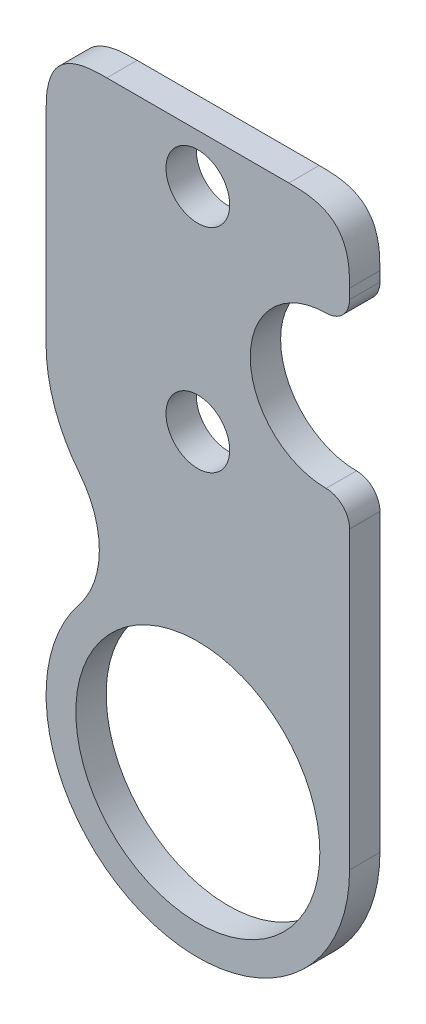
ISO-10303-21;
HEADER;
FILE_DESCRIPTION(('STEP AP214'),'2;1');
FILE_NAME('part.step','',(''),(''),'','','');
FILE_SCHEMA(('AUTOMOTIVE_DESIGN { 1 0 10303 214 1 1 1 1 }'));
ENDSEC;
DATA;
#1=APPLICATION_CONTEXT('core data for automotive mechanical design processes');
#2=APPLICATION_PROTOCOL_DEFINITION('international standard','automotive_design',2000,#1);
#3=PRODUCT_CONTEXT('',#1,'mechanical');
#4=PRODUCT('Part','Part','',(#3));
#5=PRODUCT_RELATED_PRODUCT_CATEGORY('part','',(#4));
#6=PRODUCT_DEFINITION_FORMATION('','',#4);
#7=PRODUCT_DEFINITION_CONTEXT('part definition',#1,'design');
#8=PRODUCT_DEFINITION('design','',#6,#7);
#9=PRODUCT_DEFINITION_SHAPE('','',#8);
#10=(LENGTH_UNIT() NAMED_UNIT(*) SI_UNIT(.MILLI.,.METRE.));
#11=(NAMED_UNIT(*) PLANE_ANGLE_UNIT() SI_UNIT($,.RADIAN.));
#12=(NAMED_UNIT(*) SI_UNIT($,.STERADIAN.) SOLID_ANGLE_UNIT());
#13=UNCERTAINTY_MEASURE_WITH_UNIT(LENGTH_MEASURE(1.E-05),#10,'distance_accuracy_value','');
#14=(GEOMETRIC_REPRESENTATION_CONTEXT(3) GLOBAL_UNCERTAINTY_ASSIGNED_CONTEXT((#13)) GLOBAL_UNIT_ASSIGNED_CONTEXT((#10,
#11,#12)) REPRESENTATION_CONTEXT('',''));
#15=CARTESIAN_POINT('',(0.,0.,0.));
#16=DIRECTION('',(0.,0.,1.));
#17=DIRECTION('',(1.,0.,0.));
#18=AXIS2_PLACEMENT_3D('',#15,#16,#17);
#19=CARTESIAN_POINT('',(25.,59.,-5.));
#20=DIRECTION('',(1.,0.,0.));
#21=DIRECTION('',(0.,0.,-1.));
#22=AXIS2_PLACEMENT_3D('',#19,#20,#21);
#23=PLANE('',#22);
#24=DIRECTION('',(0.,1.,0.));
#25=VECTOR('',#24,1.);
#26=CARTESIAN_POINT('',(25.,59.,-5.));
#27=LINE('',#26,#25);
#28=CARTESIAN_POINT('',(25.,47.36,-5.));
#29=VERTEX_POINT('',#28);
#30=CARTESIAN_POINT('',(25.,49.,-5.));
#31=VERTEX_POINT('',#30);
#32=EDGE_CURVE('E209',#29,#31,#27,.T.);
#33=ORIENTED_EDGE('',*,*,#32,.T.);
#34=CARTESIAN_POINT('',(25.,49.,0.250000000000083));
#35=CARTESIAN_POINT('',(25.,49.,-1.58333333333327));
#36=CARTESIAN_POINT('',(25.,49.,-3.4166666666664));
#37=CARTESIAN_POINT('',(25.,49.,-5.24999999999998));
#38=B_SPLINE_CURVE_WITH_KNOTS('',3,(#34,#35,#36,#37),.UNSPECIFIED.,.F.,.F.,(4,4),(-0.00025,
0.00525),.UNSPECIFIED.);
#39=CARTESIAN_POINT('',(25.,49.,0.));
#40=VERTEX_POINT('',#39);
#41=EDGE_CURVE('E223',#31,#40,#38,.F.);
#42=ORIENTED_EDGE('',*,*,#41,.T.);
#43=DIRECTION('',(0.,1.,0.));
#44=VECTOR('',#43,1.);
#45=CARTESIAN_POINT('',(25.,59.,0.));
#46=LINE('',#45,#44);
#47=CARTESIAN_POINT('',(25.,47.36,0.));
#48=VERTEX_POINT('',#47);
#49=EDGE_CURVE('E200',#48,#40,#46,.T.);
#50=ORIENTED_EDGE('',*,*,#49,.F.);
#51=DIRECTION('',(0.,0.,1.));
#52=VECTOR('',#51,1.);
#53=CARTESIAN_POINT('',(25.,47.36,-5.));
#54=LINE('',#53,#52);
#55=EDGE_CURVE('E402',#29,#48,#54,.T.);
#56=ORIENTED_EDGE('',*,*,#55,.F.);
#57=EDGE_LOOP('',(#33,#42,#50,#56));
#58=FACE_BOUND('',#57,.T.);
#59=ADVANCED_FACE('F44',(#58),#23,.T.);
#60=CARTESIAN_POINT('',(21.14,47.36,-5.));
#61=DIRECTION('',(0.,0.,1.));
#62=DIRECTION('',(1.,0.,0.));
#63=AXIS2_PLACEMENT_3D('',#60,#61,#62);
#64=CYLINDRICAL_SURFACE('',#63,3.86000000000001);
#65=CARTESIAN_POINT('',(21.14,47.36,0.));
#66=DIRECTION('',(0.,0.,1.));
#67=DIRECTION('',(1.,0.,0.));
#68=AXIS2_PLACEMENT_3D('',#65,#66,#67);
#69=CIRCLE('',#68,3.86000000000001);
#70=CARTESIAN_POINT('',(21.14,43.5,0.));
#71=VERTEX_POINT('',#70);
#72=EDGE_CURVE('E215',#71,#48,#69,.T.);
#73=ORIENTED_EDGE('',*,*,#72,.F.);
#74=DIRECTION('',(0.,0.,1.));
#75=VECTOR('',#74,1.);
#76=CARTESIAN_POINT('',(21.14,43.5,-5.));
#77=LINE('',#76,#75);
#78=CARTESIAN_POINT('',(21.14,43.5,-5.));
#79=VERTEX_POINT('',#78);
#80=EDGE_CURVE('E400',#79,#71,#77,.T.);
#81=ORIENTED_EDGE('',*,*,#80,.F.);
#82=CARTESIAN_POINT('',(21.14,47.36,-5.));
#83=DIRECTION('',(0.,0.,1.));
#84=DIRECTION('',(1.,0.,0.));
#85=AXIS2_PLACEMENT_3D('',#82,#83,#84);
#86=CIRCLE('',#85,3.86000000000001);
#87=EDGE_CURVE('E424',#79,#29,#86,.T.);
#88=ORIENTED_EDGE('',*,*,#87,.T.);
#89=ORIENTED_EDGE('',*,*,#55,.T.);
#90=EDGE_LOOP('',(#73,#81,#88,#89));
#91=FACE_BOUND('',#90,.T.);
#92=ADVANCED_FACE('F240',(#91),#64,.T.);
#93=CARTESIAN_POINT('',(21.14,31.,-5.));
#94=DIRECTION('',(0.,0.,1.));
#95=DIRECTION('',(1.,0.,0.));
#96=AXIS2_PLACEMENT_3D('',#93,#94,#95);
#97=CYLINDRICAL_SURFACE('',#96,12.5);
#98=CARTESIAN_POINT('',(21.14,31.,0.));
#99=DIRECTION('',(0.,0.,-1.));
#100=DIRECTION('',(1.,0.,0.));
#101=AXIS2_PLACEMENT_3D('',#98,#99,#100);
#102=CIRCLE('',#101,12.5);
#103=CARTESIAN_POINT('',(21.14,18.5,0.));
#104=VERTEX_POINT('',#103);
#105=EDGE_CURVE('E405',#104,#71,#102,.T.);
#106=ORIENTED_EDGE('',*,*,#105,.F.);
#107=DIRECTION('',(0.,0.,1.));
#108=VECTOR('',#107,1.);
#109=CARTESIAN_POINT('',(21.14,18.5,-5.));
#110=LINE('',#109,#108);
#111=CARTESIAN_POINT('',(21.14,18.5,-5.));
#112=VERTEX_POINT('',#111);
#113=EDGE_CURVE('E417',#112,#104,#110,.T.);
#114=ORIENTED_EDGE('',*,*,#113,.F.);
#115=CARTESIAN_POINT('',(21.14,31.,-5.));
#116=DIRECTION('',(0.,0.,-1.));
#117=DIRECTION('',(1.,0.,0.));
#118=AXIS2_PLACEMENT_3D('',#115,#116,#117);
#119=CIRCLE('',#118,12.5);
#120=EDGE_CURVE('E429',#112,#79,#119,.T.);
#121=ORIENTED_EDGE('',*,*,#120,.T.);
#122=ORIENTED_EDGE('',*,*,#80,.T.);
#123=EDGE_LOOP('',(#106,#114,#121,#122));
#124=FACE_BOUND('',#123,.T.);
#125=ADVANCED_FACE('F389',(#124),#97,.F.);
#126=CARTESIAN_POINT('',(21.14,14.64,-5.));
#127=DIRECTION('',(0.,0.,1.));
#128=DIRECTION('',(1.,0.,0.));
#129=AXIS2_PLACEMENT_3D('',#126,#127,#128);
#130=CYLINDRICAL_SURFACE('',#129,3.86);
#131=CARTESIAN_POINT('',(21.14,14.64,0.));
#132=DIRECTION('',(0.,0.,1.));
#133=DIRECTION('',(-1.,0.,0.));
#134=AXIS2_PLACEMENT_3D('',#131,#132,#133);
#135=CIRCLE('',#134,3.86);
#136=CARTESIAN_POINT('',(25.,14.64,0.));
#137=VERTEX_POINT('',#136);
#138=EDGE_CURVE('E409',#137,#104,#135,.T.);
#139=ORIENTED_EDGE('',*,*,#138,.F.);
#140=DIRECTION('',(0.,0.,1.));
#141=VECTOR('',#140,1.);
#142=CARTESIAN_POINT('',(25.,14.64,-5.));
#143=LINE('',#142,#141);
#144=CARTESIAN_POINT('',(25.,14.64,-5.));
#145=VERTEX_POINT('',#144);
#146=EDGE_CURVE('E420',#145,#137,#143,.T.);
#147=ORIENTED_EDGE('',*,*,#146,.F.);
#148=CARTESIAN_POINT('',(21.14,14.64,-5.));
#149=DIRECTION('',(0.,0.,1.));
#150=DIRECTION('',(-1.,0.,0.));
#151=AXIS2_PLACEMENT_3D('',#148,#149,#150);
#152=CIRCLE('',#151,3.86);
#153=EDGE_CURVE('E434',#145,#112,#152,.T.);
#154=ORIENTED_EDGE('',*,*,#153,.T.);
#155=ORIENTED_EDGE('',*,*,#113,.T.);
#156=EDGE_LOOP('',(#139,#147,#154,#155));
#157=FACE_BOUND('',#156,.T.);
#158=ADVANCED_FACE('F385',(#157),#130,.T.);
#159=CARTESIAN_POINT('',(25.,-34.,-5.));
#160=DIRECTION('',(1.,0.,0.));
#161=DIRECTION('',(0.,1.,0.));
#162=AXIS2_PLACEMENT_3D('',#159,#160,#161);
#163=PLANE('',#162);
#164=DIRECTION('',(0.,1.,0.));
#165=VECTOR('',#164,1.);
#166=CARTESIAN_POINT('',(25.,-34.,0.));
#167=LINE('',#166,#165);
#168=CARTESIAN_POINT('',(25.,-34.,0.));
#169=VERTEX_POINT('',#168);
#170=EDGE_CURVE('E510',#169,#137,#167,.T.);
#171=ORIENTED_EDGE('',*,*,#170,.F.);
#172=DIRECTION('',(0.,0.,1.));
#173=VECTOR('',#172,1.);
#174=CARTESIAN_POINT('',(25.,-34.,-5.));
#175=LINE('',#174,#173);
#176=CARTESIAN_POINT('',(25.,-34.,-5.));
#177=VERTEX_POINT('',#176);
#178=EDGE_CURVE('E422',#177,#169,#175,.T.);
#179=ORIENTED_EDGE('',*,*,#178,.F.);
#180=DIRECTION('',(0.,1.,0.));
#181=VECTOR('',#180,1.);
#182=CARTESIAN_POINT('',(25.,-34.,-5.));
#183=LINE('',#182,#181);
#184=EDGE_CURVE('E496',#177,#145,#183,.T.);
#185=ORIENTED_EDGE('',*,*,#184,.T.);
#186=ORIENTED_EDGE('',*,*,#146,.T.);
#187=EDGE_LOOP('',(#171,#179,#185,#186));
#188=FACE_BOUND('',#187,.T.);
#189=ADVANCED_FACE('F382',(#188),#163,.T.);
#190=CARTESIAN_POINT('',(0.,-34.,-5.));
#191=DIRECTION('',(0.,0.,1.));
#192=DIRECTION('',(1.,0.,0.));
#193=AXIS2_PLACEMENT_3D('',#190,#191,#192);
#194=CYLINDRICAL_SURFACE('',#193,25.);
#195=CARTESIAN_POINT('',(0.,-34.,0.));
#196=DIRECTION('',(0.,0.,1.));
#197=DIRECTION('',(1.,0.,0.));
#198=AXIS2_PLACEMENT_3D('',#195,#196,#197);
#199=CIRCLE('',#198,25.);
#200=CARTESIAN_POINT('',(-19.515618744995,-18.375,0.));
#201=VERTEX_POINT('',#200);
#202=EDGE_CURVE('E66',#201,#169,#199,.T.);
#203=ORIENTED_EDGE('',*,*,#202,.F.);
#204=DIRECTION('',(0.,0.,1.));
#205=VECTOR('',#204,1.);
#206=CARTESIAN_POINT('',(-19.515618744995,-18.375,-5.05));
#207=LINE('',#206,#205);
#208=CARTESIAN_POINT('',(-19.515618744995,-18.375,-5.));
#209=VERTEX_POINT('',#208);
#210=EDGE_CURVE('E154',#209,#201,#207,.T.);
#211=ORIENTED_EDGE('',*,*,#210,.F.);
#212=CARTESIAN_POINT('',(0.,-34.,-5.));
#213=DIRECTION('',(0.,0.,1.));
#214=DIRECTION('',(1.,0.,0.));
#215=AXIS2_PLACEMENT_3D('',#212,#213,#214);
#216=CIRCLE('',#215,25.);
#217=EDGE_CURVE('E491',#209,#177,#216,.T.);
#218=ORIENTED_EDGE('',*,*,#217,.T.);
#219=ORIENTED_EDGE('',*,*,#178,.T.);
#220=EDGE_LOOP('',(#203,#211,#218,#219));
#221=FACE_BOUND('',#220,.T.);
#222=ADVANCED_FACE('F379',(#221),#194,.T.);
#223=CARTESIAN_POINT('',(-25.,59.0000000000001,-5.));
#224=DIRECTION('',(-1.,0.,0.));
#225=DIRECTION('',(0.,-1.,0.));
#226=AXIS2_PLACEMENT_3D('',#223,#224,#225);
#227=PLANE('',#226);
#228=DIRECTION('',(0.,0.,1.));
#229=VECTOR('',#228,1.);
#230=CARTESIAN_POINT('',(-25.,16.0000000000001,-5.05));
#231=LINE('',#230,#229);
#232=CARTESIAN_POINT('',(-25.,16.0000000000001,-5.));
#233=VERTEX_POINT('',#232);
#234=CARTESIAN_POINT('',(-25.,16.0000000000001,0.));
#235=VERTEX_POINT('',#234);
#236=EDGE_CURVE('E153',#233,#235,#231,.T.);
#237=ORIENTED_EDGE('',*,*,#236,.T.);
#238=DIRECTION('',(0.,-1.,0.));
#239=VECTOR('',#238,1.);
#240=CARTESIAN_POINT('',(-25.,59.0000000000001,0.));
#241=LINE('',#240,#239);
#242=CARTESIAN_POINT('',(-25.,49.0000000000001,0.));
#243=VERTEX_POINT('',#242);
#244=EDGE_CURVE('E165',#243,#235,#241,.T.);
#245=ORIENTED_EDGE('',*,*,#244,.F.);
#246=CARTESIAN_POINT('',(-25.,49.0000000000001,-5.24999999999998));
#247=CARTESIAN_POINT('',(-25.,49.0000000000001,-3.4166666666664));
#248=CARTESIAN_POINT('',(-25.,49.0000000000001,-1.58333333333327));
#249=CARTESIAN_POINT('',(-25.,49.0000000000001,0.250000000000083));
#250=B_SPLINE_CURVE_WITH_KNOTS('',3,(#246,#247,#248,#249),.UNSPECIFIED.,.F.,.F.,(4,4),(-0.00025,
0.00525),.UNSPECIFIED.);
#251=CARTESIAN_POINT('',(-25.,49.0000000000001,-5.));
#252=VERTEX_POINT('',#251);
#253=EDGE_CURVE('E11',#243,#252,#250,.F.);
#254=ORIENTED_EDGE('',*,*,#253,.T.);
#255=DIRECTION('',(0.,-1.,0.));
#256=VECTOR('',#255,1.);
#257=CARTESIAN_POINT('',(-25.,59.0000000000001,-5.));
#258=LINE('',#257,#256);
#259=EDGE_CURVE('E469',#252,#233,#258,.T.);
#260=ORIENTED_EDGE('',*,*,#259,.T.);
#261=EDGE_LOOP('',(#237,#245,#254,#260));
#262=FACE_BOUND('',#261,.T.);
#263=ADVANCED_FACE('F370',(#262),#227,.T.);
#264=CARTESIAN_POINT('',(-25.,59.0000000000001,-5.));
#265=DIRECTION('',(0.,1.,0.));
#266=DIRECTION('',(-1.,0.,0.));
#267=AXIS2_PLACEMENT_3D('',#264,#265,#266);
#268=PLANE('',#267);
#269=DIRECTION('',(-1.,0.,0.));
#270=VECTOR('',#269,1.);
#271=CARTESIAN_POINT('',(-25.,59.0000000000001,0.));
#272=LINE('',#271,#270);
#273=CARTESIAN_POINT('',(15.,59.0000000000001,0.));
#274=VERTEX_POINT('',#273);
#275=CARTESIAN_POINT('',(-15.,59.0000000000002,0.));
#276=VERTEX_POINT('',#275);
#277=EDGE_CURVE('E229',#274,#276,#272,.T.);
#278=ORIENTED_EDGE('',*,*,#277,.F.);
#279=CARTESIAN_POINT('',(15.,59.0000000000001,-5.24999999999998));
#280=CARTESIAN_POINT('',(15.,59.0000000000001,-3.4166666666664));
#281=CARTESIAN_POINT('',(15.,59.0000000000001,-1.58333333333327));
#282=CARTESIAN_POINT('',(15.,59.0000000000001,0.250000000000083));
#283=B_SPLINE_CURVE_WITH_KNOTS('',3,(#279,#280,#281,#282),.UNSPECIFIED.,.F.,.F.,(4,4),(-0.00025,
0.00525),.UNSPECIFIED.);
#284=CARTESIAN_POINT('',(15.,59.0000000000001,-5.));
#285=VERTEX_POINT('',#284);
#286=EDGE_CURVE('E283',#274,#285,#283,.F.);
#287=ORIENTED_EDGE('',*,*,#286,.T.);
#288=DIRECTION('',(-1.,0.,0.));
#289=VECTOR('',#288,1.);
#290=CARTESIAN_POINT('',(-25.,59.0000000000001,-5.));
#291=LINE('',#290,#289);
#292=CARTESIAN_POINT('',(-15.,59.0000000000002,-5.));
#293=VERTEX_POINT('',#292);
#294=EDGE_CURVE('E214',#285,#293,#291,.T.);
#295=ORIENTED_EDGE('',*,*,#294,.T.);
#296=CARTESIAN_POINT('',(-15.,59.0000000000002,0.250000000000083));
#297=CARTESIAN_POINT('',(-15.,59.0000000000002,-1.58333333333327));
#298=CARTESIAN_POINT('',(-15.,59.0000000000002,-3.4166666666664));
#299=CARTESIAN_POINT('',(-15.,59.0000000000002,-5.24999999999998));
#300=B_SPLINE_CURVE_WITH_KNOTS('',3,(#296,#297,#298,#299),.UNSPECIFIED.,.F.,.F.,(4,4),(-0.00025,
0.00525),.UNSPECIFIED.);
#301=EDGE_CURVE('E307',#293,#276,#300,.F.);
#302=ORIENTED_EDGE('',*,*,#301,.T.);
#303=EDGE_LOOP('',(#278,#287,#295,#302));
#304=FACE_BOUND('',#303,.T.);
#305=ADVANCED_FACE('F241',(#304),#268,.T.);
#306=CARTESIAN_POINT('',(21.14,47.36,-5.));
#307=DIRECTION('',(0.,0.,1.));
#308=DIRECTION('',(1.,0.,0.));
#309=AXIS2_PLACEMENT_3D('',#306,#307,#308);
#310=PLANE('',#309);
#311=ORIENTED_EDGE('',*,*,#217,.F.);
#312=CARTESIAN_POINT('',(-31.224989991992,-9.00000000000001,-5.));
#313=DIRECTION('',(0.,0.,1.));
#314=DIRECTION('',(1.,0.,0.));
#315=AXIS2_PLACEMENT_3D('',#312,#313,#314);
#316=CIRCLE('',#315,15.);
#317=CARTESIAN_POINT('',(-19.515618744995,0.375000000000014,-5.));
#318=VERTEX_POINT('',#317);
#319=EDGE_CURVE('E173',#209,#318,#316,.T.);
#320=ORIENTED_EDGE('',*,*,#319,.T.);
#321=CARTESIAN_POINT('',(0.,16.0000000000001,-5.));
#322=DIRECTION('',(0.,0.,1.));
#323=DIRECTION('',(1.,0.,0.));
#324=AXIS2_PLACEMENT_3D('',#321,#322,#323);
#325=CIRCLE('',#324,25.);
#326=EDGE_CURVE('E148',#318,#233,#325,.F.);
#327=ORIENTED_EDGE('',*,*,#326,.T.);
#328=ORIENTED_EDGE('',*,*,#259,.F.);
#329=CARTESIAN_POINT('',(-15.,59.0000000000002,-4.99999999999997));
#330=CARTESIAN_POINT('',(-16.6819805153395,59.0000000000001,-4.99999999999997));
#331=CARTESIAN_POINT('',(-18.3639610306789,59.0000000000002,-4.99999999999997));
#332=CARTESIAN_POINT('',(-22.0710678118655,58.2830808016392,-4.99999999999997));
#333=CARTESIAN_POINT('',(-24.2830808016392,56.0710678118656,-4.99999999999997));
#334=CARTESIAN_POINT('',(-25.,52.363961030679,-4.99999999999997));
#335=CARTESIAN_POINT('',(-25.,50.6819805153396,-4.99999999999997));
#336=CARTESIAN_POINT('',(-25.,49.0000000000001,-4.99999999999997));
#337=B_SPLINE_CURVE_WITH_KNOTS('',5,(#329,#330,#331,#332,#333,#334,#335,#336),.UNSPECIFIED.,.F.,
.F.,(6,2,6),(0.,0.5,1.),.UNSPECIFIED.);
#338=EDGE_CURVE('E317',#252,#293,#337,.F.);
#339=ORIENTED_EDGE('',*,*,#338,.T.);
#340=ORIENTED_EDGE('',*,*,#294,.F.);
#341=CARTESIAN_POINT('',(25.,49.,-4.99999999999997));
#342=CARTESIAN_POINT('',(25.,50.6819805153395,-4.99999999999997));
#343=CARTESIAN_POINT('',(25.,52.3639610306789,-4.99999999999997));
#344=CARTESIAN_POINT('',(24.2830808016391,56.0710678118655,-4.99999999999997));
#345=CARTESIAN_POINT('',(22.0710678118655,58.2830808016392,-4.99999999999997));
#346=CARTESIAN_POINT('',(18.3639610306789,59.0000000000001,-4.99999999999997));
#347=CARTESIAN_POINT('',(16.6819805153395,59.0000000000002,-4.99999999999997));
#348=CARTESIAN_POINT('',(15.,59.0000000000001,-4.99999999999997));
#349=B_SPLINE_CURVE_WITH_KNOTS('',5,(#341,#342,#343,#344,#345,#346,#347,#348),.UNSPECIFIED.,.F.,
.F.,(6,2,6),(0.,0.5,1.),.UNSPECIFIED.);
#350=EDGE_CURVE('E59',#285,#31,#349,.F.);
#351=ORIENTED_EDGE('',*,*,#350,.T.);
#352=ORIENTED_EDGE('',*,*,#32,.F.);
#353=ORIENTED_EDGE('',*,*,#87,.F.);
#354=ORIENTED_EDGE('',*,*,#120,.F.);
#355=ORIENTED_EDGE('',*,*,#153,.F.);
#356=ORIENTED_EDGE('',*,*,#184,.F.);
#357=EDGE_LOOP('',(#311,#320,#327,#328,#339,#340,#351,#352,#353,#354,#355,#356));
#358=FACE_BOUND('',#357,.T.);
#359=CARTESIAN_POINT('',(0.,51.,-5.));
#360=DIRECTION('',(0.,0.,1.));
#361=DIRECTION('',(1.,0.,0.));
#362=AXIS2_PLACEMENT_3D('',#359,#360,#361);
#363=CIRCLE('',#362,5.25);
#364=CARTESIAN_POINT('',(5.25,51.,-5.));
#365=VERTEX_POINT('',#364);
#366=EDGE_CURVE('E180',#365,#365,#363,.T.);
#367=ORIENTED_EDGE('',*,*,#366,.T.);
#368=EDGE_LOOP('',(#367));
#369=FACE_BOUND('',#368,.T.);
#370=CARTESIAN_POINT('',(0.,16.0000000000001,-5.));
#371=DIRECTION('',(0.,0.,1.));
#372=DIRECTION('',(1.,0.,0.));
#373=AXIS2_PLACEMENT_3D('',#370,#371,#372);
#374=CIRCLE('',#373,5.25);
#375=CARTESIAN_POINT('',(5.25,16.0000000000001,-5.));
#376=VERTEX_POINT('',#375);
#377=EDGE_CURVE('E188',#376,#376,#374,.T.);
#378=ORIENTED_EDGE('',*,*,#377,.T.);
#379=EDGE_LOOP('',(#378));
#380=FACE_BOUND('',#379,.T.);
#381=CARTESIAN_POINT('',(0.,-34.,-5.));
#382=DIRECTION('',(0.,0.,1.));
#383=DIRECTION('',(1.,0.,0.));
#384=AXIS2_PLACEMENT_3D('',#381,#382,#383);
#385=CIRCLE('',#384,20.1);
#386=CARTESIAN_POINT('',(20.1,-34.,-5.));
#387=VERTEX_POINT('',#386);
#388=EDGE_CURVE('E196',#387,#387,#385,.T.);
#389=ORIENTED_EDGE('',*,*,#388,.T.);
#390=EDGE_LOOP('',(#389));
#391=FACE_BOUND('',#390,.T.);
#392=ADVANCED_FACE('F346',(#358,#369,#380,#391),#310,.F.);
#393=CARTESIAN_POINT('',(21.14,47.36,0.));
#394=DIRECTION('',(0.,0.,1.));
#395=DIRECTION('',(1.,0.,0.));
#396=AXIS2_PLACEMENT_3D('',#393,#394,#395);
#397=PLANE('',#396);
#398=CARTESIAN_POINT('',(-31.224989991992,-9.00000000000001,0.));
#399=DIRECTION('',(0.,0.,1.));
#400=DIRECTION('',(-1.,0.,0.));
#401=AXIS2_PLACEMENT_3D('',#398,#399,#400);
#402=CIRCLE('',#401,15.);
#403=CARTESIAN_POINT('',(-19.515618744995,0.375000000000014,0.));
#404=VERTEX_POINT('',#403);
#405=EDGE_CURVE('E157',#201,#404,#402,.T.);
#406=ORIENTED_EDGE('',*,*,#405,.F.);
#407=ORIENTED_EDGE('',*,*,#202,.T.);
#408=ORIENTED_EDGE('',*,*,#170,.T.);
#409=ORIENTED_EDGE('',*,*,#138,.T.);
#410=ORIENTED_EDGE('',*,*,#105,.T.);
#411=ORIENTED_EDGE('',*,*,#72,.T.);
#412=ORIENTED_EDGE('',*,*,#49,.T.);
#413=CARTESIAN_POINT('',(15.,59.0000000000001,0.));
#414=CARTESIAN_POINT('',(16.6819805153395,59.0000000000002,0.));
#415=CARTESIAN_POINT('',(18.3639610306789,59.0000000000001,0.));
#416=CARTESIAN_POINT('',(22.0710678118655,58.2830808016392,0.));
#417=CARTESIAN_POINT('',(24.2830808016391,56.0710678118655,0.));
#418=CARTESIAN_POINT('',(25.,52.3639610306789,0.));
#419=CARTESIAN_POINT('',(25.,50.6819805153395,0.));
#420=CARTESIAN_POINT('',(25.,49.,0.));
#421=B_SPLINE_CURVE_WITH_KNOTS('',5,(#413,#414,#415,#416,#417,#418,#419,#420),.UNSPECIFIED.,.F.,
.F.,(6,2,6),(0.,0.5,1.),.UNSPECIFIED.);
#422=EDGE_CURVE('E456',#40,#274,#421,.F.);
#423=ORIENTED_EDGE('',*,*,#422,.T.);
#424=ORIENTED_EDGE('',*,*,#277,.T.);
#425=CARTESIAN_POINT('',(-25.,49.0000000000001,0.));
#426=CARTESIAN_POINT('',(-25.,50.6819805153396,0.));
#427=CARTESIAN_POINT('',(-25.,52.363961030679,0.));
#428=CARTESIAN_POINT('',(-24.2830808016392,56.0710678118656,0.));
#429=CARTESIAN_POINT('',(-22.0710678118655,58.2830808016392,0.));
#430=CARTESIAN_POINT('',(-18.3639610306789,59.0000000000002,0.));
#431=CARTESIAN_POINT('',(-16.6819805153395,59.0000000000001,0.));
#432=CARTESIAN_POINT('',(-15.,59.0000000000002,0.));
#433=B_SPLINE_CURVE_WITH_KNOTS('',5,(#425,#426,#427,#428,#429,#430,#431,#432),.UNSPECIFIED.,.F.,
.F.,(6,2,6),(0.,0.5,1.),.UNSPECIFIED.);
#434=EDGE_CURVE('E295',#276,#243,#433,.F.);
#435=ORIENTED_EDGE('',*,*,#434,.T.);
#436=ORIENTED_EDGE('',*,*,#244,.T.);
#437=CARTESIAN_POINT('',(0.,16.0000000000001,0.));
#438=DIRECTION('',(0.,0.,-1.));
#439=DIRECTION('',(1.,0.,0.));
#440=AXIS2_PLACEMENT_3D('',#437,#438,#439);
#441=CIRCLE('',#440,25.);
#442=EDGE_CURVE('E145',#404,#235,#441,.T.);
#443=ORIENTED_EDGE('',*,*,#442,.F.);
#444=EDGE_LOOP('',(#406,#407,#408,#409,#410,#411,#412,#423,#424,#435,#436,#443));
#445=FACE_BOUND('',#444,.T.);
#446=CARTESIAN_POINT('',(0.,51.,0.));
#447=DIRECTION('',(0.,0.,1.));
#448=DIRECTION('',(1.,0.,0.));
#449=AXIS2_PLACEMENT_3D('',#446,#447,#448);
#450=CIRCLE('',#449,5.25);
#451=CARTESIAN_POINT('',(5.25,51.,0.));
#452=VERTEX_POINT('',#451);
#453=EDGE_CURVE('E179',#452,#452,#450,.T.);
#454=ORIENTED_EDGE('',*,*,#453,.F.);
#455=EDGE_LOOP('',(#454));
#456=FACE_BOUND('',#455,.T.);
#457=CARTESIAN_POINT('',(0.,16.0000000000001,0.));
#458=DIRECTION('',(0.,0.,1.));
#459=DIRECTION('',(1.,0.,0.));
#460=AXIS2_PLACEMENT_3D('',#457,#458,#459);
#461=CIRCLE('',#460,5.25);
#462=CARTESIAN_POINT('',(5.25,16.0000000000001,0.));
#463=VERTEX_POINT('',#462);
#464=EDGE_CURVE('E184',#463,#463,#461,.T.);
#465=ORIENTED_EDGE('',*,*,#464,.F.);
#466=EDGE_LOOP('',(#465));
#467=FACE_BOUND('',#466,.T.);
#468=CARTESIAN_POINT('',(0.,-34.,0.));
#469=DIRECTION('',(0.,0.,1.));
#470=DIRECTION('',(1.,0.,0.));
#471=AXIS2_PLACEMENT_3D('',#468,#469,#470);
#472=CIRCLE('',#471,20.1);
#473=CARTESIAN_POINT('',(20.1,-34.,0.));
#474=VERTEX_POINT('',#473);
#475=EDGE_CURVE('E192',#474,#474,#472,.T.);
#476=ORIENTED_EDGE('',*,*,#475,.F.);
#477=EDGE_LOOP('',(#476));
#478=FACE_BOUND('',#477,.T.);
#479=ADVANCED_FACE('F163',(#445,#456,#467,#478),#397,.T.);
#480=CARTESIAN_POINT('',(0.,-34.,-5.));
#481=DIRECTION('',(0.,0.,1.));
#482=DIRECTION('',(1.,0.,0.));
#483=AXIS2_PLACEMENT_3D('',#480,#481,#482);
#484=CYLINDRICAL_SURFACE('',#483,20.1);
#485=ORIENTED_EDGE('',*,*,#388,.F.);
#486=EDGE_LOOP('',(#485));
#487=FACE_BOUND('',#486,.T.);
#488=ORIENTED_EDGE('',*,*,#475,.T.);
#489=EDGE_LOOP('',(#488));
#490=FACE_BOUND('',#489,.T.);
#491=ADVANCED_FACE('F341',(#487,#490),#484,.F.);
#492=CARTESIAN_POINT('',(0.,16.0000000000001,-5.));
#493=DIRECTION('',(0.,0.,1.));
#494=DIRECTION('',(1.,0.,0.));
#495=AXIS2_PLACEMENT_3D('',#492,#493,#494);
#496=CYLINDRICAL_SURFACE('',#495,5.25);
#497=ORIENTED_EDGE('',*,*,#377,.F.);
#498=EDGE_LOOP('',(#497));
#499=FACE_BOUND('',#498,.T.);
#500=ORIENTED_EDGE('',*,*,#464,.T.);
#501=EDGE_LOOP('',(#500));
#502=FACE_BOUND('',#501,.T.);
#503=ADVANCED_FACE('F337',(#499,#502),#496,.F.);
#504=CARTESIAN_POINT('',(0.,51.,-5.));
#505=DIRECTION('',(0.,0.,1.));
#506=DIRECTION('',(1.,0.,0.));
#507=AXIS2_PLACEMENT_3D('',#504,#505,#506);
#508=CYLINDRICAL_SURFACE('',#507,5.25);
#509=ORIENTED_EDGE('',*,*,#366,.F.);
#510=EDGE_LOOP('',(#509));
#511=FACE_BOUND('',#510,.T.);
#512=ORIENTED_EDGE('',*,*,#453,.T.);
#513=EDGE_LOOP('',(#512));
#514=FACE_BOUND('',#513,.T.);
#515=ADVANCED_FACE('F252',(#511,#514),#508,.F.);
#516=CARTESIAN_POINT('',(25.,49.,-5.24999999999998));
#517=CARTESIAN_POINT('',(25.,49.,-3.4166666666664));
#518=CARTESIAN_POINT('',(25.,49.,-1.58333333333327));
#519=CARTESIAN_POINT('',(25.,49.,0.250000000000083));
#520=CARTESIAN_POINT('',(25.,50.6819805153395,-5.24999999999998));
#521=CARTESIAN_POINT('',(25.,50.6819805153395,-3.4166666666664));
#522=CARTESIAN_POINT('',(25.,50.6819805153395,-1.58333333333327));
#523=CARTESIAN_POINT('',(25.,50.6819805153395,0.250000000000083));
#524=CARTESIAN_POINT('',(25.,52.3639610306789,-5.24999999999998));
#525=CARTESIAN_POINT('',(25.,52.3639610306789,-3.4166666666664));
#526=CARTESIAN_POINT('',(25.,52.3639610306789,-1.58333333333327));
#527=CARTESIAN_POINT('',(25.,52.3639610306789,0.250000000000083));
#528=CARTESIAN_POINT('',(24.2830808016391,56.0710678118655,-5.24999999999998));
#529=CARTESIAN_POINT('',(24.2830808016391,56.0710678118655,-3.4166666666664));
#530=CARTESIAN_POINT('',(24.2830808016391,56.0710678118655,-1.58333333333327));
#531=CARTESIAN_POINT('',(24.2830808016391,56.0710678118655,0.250000000000083));
#532=CARTESIAN_POINT('',(22.0710678118655,58.2830808016392,-5.24999999999998));
#533=CARTESIAN_POINT('',(22.0710678118655,58.2830808016392,-3.4166666666664));
#534=CARTESIAN_POINT('',(22.0710678118655,58.2830808016392,-1.58333333333327));
#535=CARTESIAN_POINT('',(22.0710678118655,58.2830808016392,0.250000000000083));
#536=CARTESIAN_POINT('',(18.3639610306789,59.0000000000001,-5.24999999999998));
#537=CARTESIAN_POINT('',(18.3639610306789,59.0000000000001,-3.4166666666664));
#538=CARTESIAN_POINT('',(18.3639610306789,59.0000000000001,-1.58333333333327));
#539=CARTESIAN_POINT('',(18.3639610306789,59.0000000000001,0.250000000000083));
#540=CARTESIAN_POINT('',(16.6819805153395,59.0000000000002,-5.24999999999998));
#541=CARTESIAN_POINT('',(16.6819805153395,59.0000000000002,-3.4166666666664));
#542=CARTESIAN_POINT('',(16.6819805153395,59.0000000000002,-1.58333333333327));
#543=CARTESIAN_POINT('',(16.6819805153395,59.0000000000002,0.250000000000083));
#544=CARTESIAN_POINT('',(15.,59.0000000000001,-5.24999999999998));
#545=CARTESIAN_POINT('',(15.,59.0000000000001,-3.4166666666664));
#546=CARTESIAN_POINT('',(15.,59.0000000000001,-1.58333333333327));
#547=CARTESIAN_POINT('',(15.,59.0000000000001,0.250000000000083));
#548=B_SPLINE_SURFACE_WITH_KNOTS('',5,3,((#516,#517,#518,#519),(#520,#521,#522,#523),(#524,#525,
#526,#527),(#528,#529,#530,#531),(#532,#533,#534,#535),(#536,#537,#538,#539),(#540,#541,#542,
#543),(#544,#545,#546,#547)),.UNSPECIFIED.,.F.,.F.,.F.,(6,2,6),(4,4),(0.,0.5,1.),(-0.00025,
0.00525),.UNSPECIFIED.);
#549=ORIENTED_EDGE('',*,*,#350,.F.);
#550=ORIENTED_EDGE('',*,*,#286,.F.);
#551=ORIENTED_EDGE('',*,*,#422,.F.);
#552=ORIENTED_EDGE('',*,*,#41,.F.);
#553=EDGE_LOOP('',(#549,#550,#551,#552));
#554=FACE_BOUND('',#553,.T.);
#555=ADVANCED_FACE('F245',(#554),#548,.T.);
#556=CARTESIAN_POINT('',(-15.,59.0000000000002,-5.24999999999998));
#557=CARTESIAN_POINT('',(-15.,59.0000000000002,-3.4166666666664));
#558=CARTESIAN_POINT('',(-15.,59.0000000000002,-1.58333333333327));
#559=CARTESIAN_POINT('',(-15.,59.0000000000002,0.250000000000083));
#560=CARTESIAN_POINT('',(-16.6819805153395,59.0000000000001,-5.24999999999998));
#561=CARTESIAN_POINT('',(-16.6819805153395,59.0000000000001,-3.4166666666664));
#562=CARTESIAN_POINT('',(-16.6819805153395,59.0000000000001,-1.58333333333327));
#563=CARTESIAN_POINT('',(-16.6819805153395,59.0000000000001,0.250000000000083));
#564=CARTESIAN_POINT('',(-18.3639610306789,59.0000000000002,-5.24999999999998));
#565=CARTESIAN_POINT('',(-18.3639610306789,59.0000000000002,-3.4166666666664));
#566=CARTESIAN_POINT('',(-18.3639610306789,59.0000000000002,-1.58333333333327));
#567=CARTESIAN_POINT('',(-18.3639610306789,59.0000000000002,0.250000000000083));
#568=CARTESIAN_POINT('',(-22.0710678118655,58.2830808016392,-5.24999999999998));
#569=CARTESIAN_POINT('',(-22.0710678118655,58.2830808016392,-3.4166666666664));
#570=CARTESIAN_POINT('',(-22.0710678118655,58.2830808016392,-1.58333333333327));
#571=CARTESIAN_POINT('',(-22.0710678118655,58.2830808016392,0.250000000000083));
#572=CARTESIAN_POINT('',(-24.2830808016392,56.0710678118656,-5.24999999999998));
#573=CARTESIAN_POINT('',(-24.2830808016392,56.0710678118656,-3.4166666666664));
#574=CARTESIAN_POINT('',(-24.2830808016392,56.0710678118656,-1.58333333333327));
#575=CARTESIAN_POINT('',(-24.2830808016392,56.0710678118656,0.250000000000083));
#576=CARTESIAN_POINT('',(-25.,52.363961030679,-5.24999999999998));
#577=CARTESIAN_POINT('',(-25.,52.363961030679,-3.4166666666664));
#578=CARTESIAN_POINT('',(-25.,52.363961030679,-1.58333333333327));
#579=CARTESIAN_POINT('',(-25.,52.363961030679,0.250000000000083));
#580=CARTESIAN_POINT('',(-25.,50.6819805153396,-5.24999999999998));
#581=CARTESIAN_POINT('',(-25.,50.6819805153396,-3.4166666666664));
#582=CARTESIAN_POINT('',(-25.,50.6819805153396,-1.58333333333327));
#583=CARTESIAN_POINT('',(-25.,50.6819805153396,0.250000000000083));
#584=CARTESIAN_POINT('',(-25.,49.0000000000001,-5.24999999999998));
#585=CARTESIAN_POINT('',(-25.,49.0000000000001,-3.4166666666664));
#586=CARTESIAN_POINT('',(-25.,49.0000000000001,-1.58333333333327));
#587=CARTESIAN_POINT('',(-25.,49.0000000000001,0.250000000000083));
#588=B_SPLINE_SURFACE_WITH_KNOTS('',5,3,((#556,#557,#558,#559),(#560,#561,#562,#563),(#564,#565,
#566,#567),(#568,#569,#570,#571),(#572,#573,#574,#575),(#576,#577,#578,#579),(#580,#581,#582,
#583),(#584,#585,#586,#587)),.UNSPECIFIED.,.F.,.F.,.F.,(6,2,6),(4,4),(0.,0.5,1.),(-0.00025,
0.00525),.UNSPECIFIED.);
#589=ORIENTED_EDGE('',*,*,#338,.F.);
#590=ORIENTED_EDGE('',*,*,#253,.F.);
#591=ORIENTED_EDGE('',*,*,#434,.F.);
#592=ORIENTED_EDGE('',*,*,#301,.F.);
#593=EDGE_LOOP('',(#589,#590,#591,#592));
#594=FACE_BOUND('',#593,.T.);
#595=ADVANCED_FACE('F47',(#594),#588,.T.);
#596=CARTESIAN_POINT('',(0.,16.0000000000001,-5.05));
#597=DIRECTION('',(0.,0.,1.));
#598=DIRECTION('',(1.,0.,0.));
#599=AXIS2_PLACEMENT_3D('',#596,#597,#598);
#600=CYLINDRICAL_SURFACE('',#599,25.);
#601=DIRECTION('',(0.,0.,1.));
#602=VECTOR('',#601,1.);
#603=CARTESIAN_POINT('',(-19.515618744995,0.375000000000014,-5.05));
#604=LINE('',#603,#602);
#605=EDGE_CURVE('E141',#318,#404,#604,.T.);
#606=ORIENTED_EDGE('',*,*,#605,.T.);
#607=ORIENTED_EDGE('',*,*,#442,.T.);
#608=ORIENTED_EDGE('',*,*,#236,.F.);
#609=ORIENTED_EDGE('',*,*,#326,.F.);
#610=EDGE_LOOP('',(#606,#607,#608,#609));
#611=FACE_BOUND('',#610,.T.);
#612=ADVANCED_FACE('F143',(#611),#600,.T.);
#613=CARTESIAN_POINT('',(-31.224989991992,-9.00000000000001,-5.05));
#614=DIRECTION('',(0.,0.,1.));
#615=DIRECTION('',(1.,0.,0.));
#616=AXIS2_PLACEMENT_3D('',#613,#614,#615);
#617=CYLINDRICAL_SURFACE('',#616,15.);
#618=ORIENTED_EDGE('',*,*,#210,.T.);
#619=ORIENTED_EDGE('',*,*,#405,.T.);
#620=ORIENTED_EDGE('',*,*,#605,.F.);
#621=ORIENTED_EDGE('',*,*,#319,.F.);
#622=EDGE_LOOP('',(#618,#619,#620,#621));
#623=FACE_BOUND('',#622,.T.);
#624=ADVANCED_FACE('F158',(#623),#617,.F.);
#625=CLOSED_SHELL('',(#59,#92,#125,#158,#189,#222,#263,#305,#392,#479,#491,#503,#515,#555,#595,
#612,#624));
#626=MANIFOLD_SOLID_BREP('B2',#625);
#627=ADVANCED_BREP_SHAPE_REPRESENTATION('',(#18,#626),#14);
#628=SHAPE_DEFINITION_REPRESENTATION(#9,#627);
ENDSEC;
END-ISO-10303-21;
